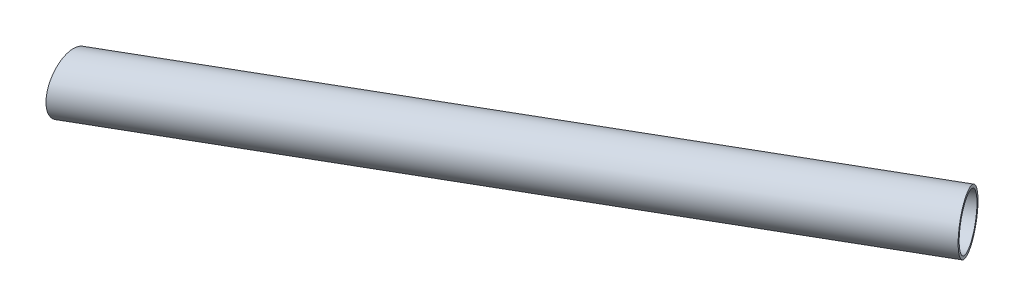
ISO-10303-21;
HEADER;
FILE_DESCRIPTION(('STEP AP214'),'2;1');
FILE_NAME('part.step','',(''),(''),'','','');
FILE_SCHEMA(('AUTOMOTIVE_DESIGN { 1 0 10303 214 1 1 1 1 }'));
ENDSEC;
DATA;
#1=APPLICATION_CONTEXT('core data for automotive mechanical design processes');
#2=APPLICATION_PROTOCOL_DEFINITION('international standard','automotive_design',2000,#1);
#3=PRODUCT_CONTEXT('',#1,'mechanical');
#4=PRODUCT('Part','Part','',(#3));
#5=PRODUCT_RELATED_PRODUCT_CATEGORY('part','',(#4));
#6=PRODUCT_DEFINITION_FORMATION('','',#4);
#7=PRODUCT_DEFINITION_CONTEXT('part definition',#1,'design');
#8=PRODUCT_DEFINITION('design','',#6,#7);
#9=PRODUCT_DEFINITION_SHAPE('','',#8);
#10=(LENGTH_UNIT() NAMED_UNIT(*) SI_UNIT(.MILLI.,.METRE.));
#11=(NAMED_UNIT(*) PLANE_ANGLE_UNIT() SI_UNIT($,.RADIAN.));
#12=(NAMED_UNIT(*) SI_UNIT($,.STERADIAN.) SOLID_ANGLE_UNIT());
#13=UNCERTAINTY_MEASURE_WITH_UNIT(LENGTH_MEASURE(1.E-05),#10,'distance_accuracy_value','');
#14=(GEOMETRIC_REPRESENTATION_CONTEXT(3) GLOBAL_UNCERTAINTY_ASSIGNED_CONTEXT((#13)) GLOBAL_UNIT_ASSIGNED_CONTEXT((#10,
#11,#12)) REPRESENTATION_CONTEXT('',''));
#15=CARTESIAN_POINT('',(0.,0.,0.));
#16=DIRECTION('',(0.,0.,1.));
#17=DIRECTION('',(1.,0.,0.));
#18=AXIS2_PLACEMENT_3D('',#15,#16,#17);
#19=CARTESIAN_POINT('',(266.842348215219,-9.535,125.404896227988));
#20=DIRECTION('',(0.983236565805895,0.,-0.182334460983735));
#21=DIRECTION('',(-0.182334460983735,0.,-0.983236565805895));
#22=AXIS2_PLACEMENT_3D('',#19,#20,#21);
#23=PLANE('',#22);
#24=CARTESIAN_POINT('',(265.,0.,115.470053837923));
#25=DIRECTION('',(0.983236565805895,0.,-0.182334460983736));
#26=DIRECTION('',(0.182334460983736,0.,0.983236565805895));
#27=AXIS2_PLACEMENT_3D('',#24,#25,#26);
#28=ELLIPSE('',#27,10.1042238821962,9.525);
#29=CARTESIAN_POINT('',(266.842348215219,0.,125.404896227988));
#30=VERTEX_POINT('',#29);
#31=EDGE_CURVE('E10',#30,#30,#28,.F.);
#32=ORIENTED_EDGE('',*,*,#31,.T.);
#33=EDGE_LOOP('',(#32));
#34=FACE_BOUND('',#33,.T.);
#35=CARTESIAN_POINT('',(265.,0.,115.470053837923));
#36=DIRECTION('',(0.983236565805895,0.,-0.182334460983736));
#37=DIRECTION('',(0.182334460983736,0.,0.983236565805895));
#38=AXIS2_PLACEMENT_3D('',#35,#36,#37);
#39=ELLIPSE('',#38,9.04341297592888,8.525);
#40=CARTESIAN_POINT('',(266.648925830419,0.,124.36186815554));
#41=VERTEX_POINT('',#40);
#42=EDGE_CURVE('E48',#41,#41,#39,.F.);
#43=ORIENTED_EDGE('',*,*,#42,.F.);
#44=EDGE_LOOP('',(#43));
#45=FACE_BOUND('',#44,.T.);
#46=ADVANCED_FACE('F38',(#34,#45),#23,.F.);
#47=CARTESIAN_POINT('',(465.,0.,-2.22044604925031E-13));
#48=DIRECTION('',(0.866025403784442,0.,-0.499999999999995));
#49=DIRECTION('',(-0.499999999999995,0.,-0.866025403784442));
#50=AXIS2_PLACEMENT_3D('',#47,#48,#49);
#51=PLANE('',#50);
#52=CARTESIAN_POINT('',(465.,0.,-2.08166817117217E-13));
#53=DIRECTION('',(0.866025403784442,0.,-0.499999999999995));
#54=DIRECTION('',(-0.499999999999995,0.,-0.866025403784442));
#55=AXIS2_PLACEMENT_3D('',#52,#53,#54);
#56=CIRCLE('',#55,8.525);
#57=CARTESIAN_POINT('',(460.7375,0.,-7.38286656726257));
#58=VERTEX_POINT('',#57);
#59=EDGE_CURVE('E50',#58,#58,#56,.T.);
#60=ORIENTED_EDGE('',*,*,#59,.F.);
#61=EDGE_LOOP('',(#60));
#62=FACE_BOUND('',#61,.T.);
#63=CARTESIAN_POINT('',(465.,0.,-2.22044604925031E-13));
#64=DIRECTION('',(0.866025403784442,0.,-0.499999999999995));
#65=DIRECTION('',(-0.499999999999995,0.,-0.866025403784442));
#66=AXIS2_PLACEMENT_3D('',#63,#64,#65);
#67=CIRCLE('',#66,9.525);
#68=CARTESIAN_POINT('',(460.2375,0.,-8.24889197104703));
#69=VERTEX_POINT('',#68);
#70=EDGE_CURVE('E41',#69,#69,#67,.T.);
#71=ORIENTED_EDGE('',*,*,#70,.T.);
#72=EDGE_LOOP('',(#71));
#73=FACE_BOUND('',#72,.T.);
#74=ADVANCED_FACE('F60',(#62,#73),#51,.T.);
#75=CARTESIAN_POINT('',(261.701230496363,0.,117.374599298843));
#76=DIRECTION('',(0.866025403784442,0.,-0.499999999999995));
#77=DIRECTION('',(-0.499999999999995,0.,-0.866025403784442));
#78=AXIS2_PLACEMENT_3D('',#75,#76,#77);
#79=CYLINDRICAL_SURFACE('',#78,8.525);
#80=ORIENTED_EDGE('',*,*,#42,.T.);
#81=EDGE_LOOP('',(#80));
#82=FACE_BOUND('',#81,.T.);
#83=ORIENTED_EDGE('',*,*,#59,.T.);
#84=EDGE_LOOP('',(#83));
#85=FACE_BOUND('',#84,.T.);
#86=ADVANCED_FACE('F56',(#82,#85),#79,.F.);
#87=CARTESIAN_POINT('',(261.701230496363,0.,117.374599298843));
#88=DIRECTION('',(0.866025403784442,0.,-0.499999999999995));
#89=DIRECTION('',(-0.499999999999995,0.,-0.866025403784442));
#90=AXIS2_PLACEMENT_3D('',#87,#88,#89);
#91=CYLINDRICAL_SURFACE('',#90,9.525);
#92=ORIENTED_EDGE('',*,*,#31,.F.);
#93=EDGE_LOOP('',(#92));
#94=FACE_BOUND('',#93,.T.);
#95=ORIENTED_EDGE('',*,*,#70,.F.);
#96=EDGE_LOOP('',(#95));
#97=FACE_BOUND('',#96,.T.);
#98=ADVANCED_FACE('F61',(#94,#97),#91,.T.);
#99=CLOSED_SHELL('',(#46,#74,#86,#98));
#100=MANIFOLD_SOLID_BREP('B2',#99);
#101=ADVANCED_BREP_SHAPE_REPRESENTATION('',(#18,#100),#14);
#102=SHAPE_DEFINITION_REPRESENTATION(#9,#101);
ENDSEC;
END-ISO-10303-21;
